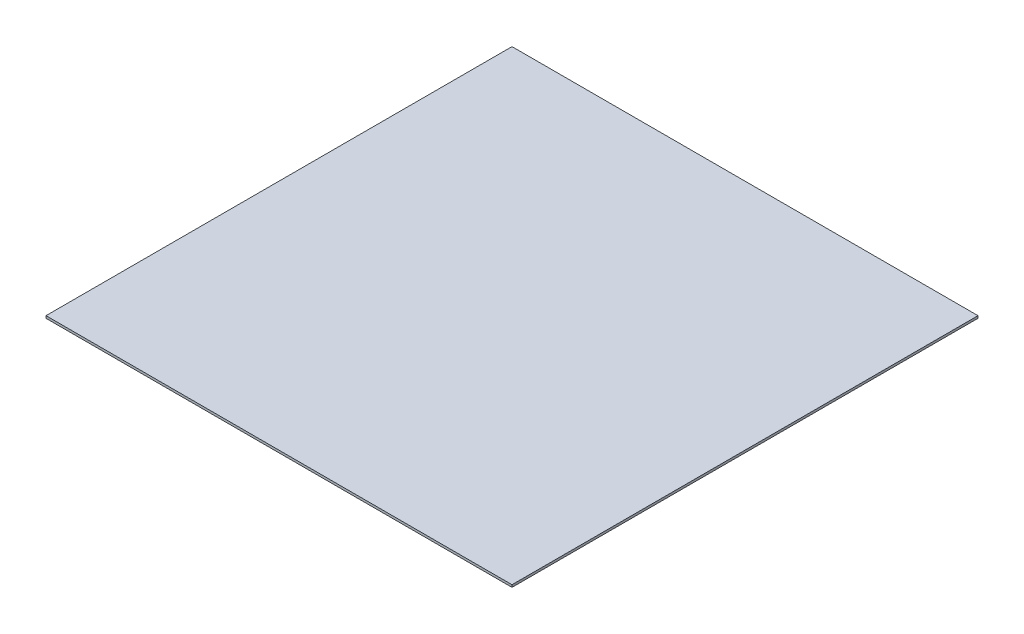
ISO-10303-21;
HEADER;
FILE_DESCRIPTION(('STEP AP214'),'2;1');
FILE_NAME('part.step','',(''),(''),'','','');
FILE_SCHEMA(('AUTOMOTIVE_DESIGN { 1 0 10303 214 1 1 1 1 }'));
ENDSEC;
DATA;
#1=APPLICATION_CONTEXT('core data for automotive mechanical design processes');
#2=APPLICATION_PROTOCOL_DEFINITION('international standard','automotive_design',2000,#1);
#3=PRODUCT_CONTEXT('',#1,'mechanical');
#4=PRODUCT('Part','Part','',(#3));
#5=PRODUCT_RELATED_PRODUCT_CATEGORY('part','',(#4));
#6=PRODUCT_DEFINITION_FORMATION('','',#4);
#7=PRODUCT_DEFINITION_CONTEXT('part definition',#1,'design');
#8=PRODUCT_DEFINITION('design','',#6,#7);
#9=PRODUCT_DEFINITION_SHAPE('','',#8);
#10=(LENGTH_UNIT() NAMED_UNIT(*) SI_UNIT(.MILLI.,.METRE.));
#11=(NAMED_UNIT(*) PLANE_ANGLE_UNIT() SI_UNIT($,.RADIAN.));
#12=(NAMED_UNIT(*) SI_UNIT($,.STERADIAN.) SOLID_ANGLE_UNIT());
#13=UNCERTAINTY_MEASURE_WITH_UNIT(LENGTH_MEASURE(1.E-05),#10,'distance_accuracy_value','');
#14=(GEOMETRIC_REPRESENTATION_CONTEXT(3) GLOBAL_UNCERTAINTY_ASSIGNED_CONTEXT((#13)) GLOBAL_UNIT_ASSIGNED_CONTEXT((#10,
#11,#12)) REPRESENTATION_CONTEXT('',''));
#15=CARTESIAN_POINT('',(0.,0.,0.));
#16=DIRECTION('',(0.,0.,1.));
#17=DIRECTION('',(1.,0.,0.));
#18=AXIS2_PLACEMENT_3D('',#15,#16,#17);
#19=CARTESIAN_POINT('',(1000.,10.,-1000.));
#20=DIRECTION('',(-1.,0.,0.));
#21=DIRECTION('',(0.,0.,1.));
#22=AXIS2_PLACEMENT_3D('',#19,#20,#21);
#23=PLANE('',#22);
#24=DIRECTION('',(0.,0.,-1.));
#25=VECTOR('',#24,1.);
#26=CARTESIAN_POINT('',(1000.,0.,-1000.));
#27=LINE('',#26,#25);
#28=CARTESIAN_POINT('',(1000.,0.,1000.));
#29=VERTEX_POINT('',#28);
#30=CARTESIAN_POINT('',(1000.,0.,-1000.));
#31=VERTEX_POINT('',#30);
#32=EDGE_CURVE('E119',#29,#31,#27,.T.);
#33=ORIENTED_EDGE('',*,*,#32,.T.);
#34=DIRECTION('',(0.,-1.,0.));
#35=VECTOR('',#34,1.);
#36=CARTESIAN_POINT('',(1000.,10.,-1000.));
#37=LINE('',#36,#35);
#38=CARTESIAN_POINT('',(1000.,10.,-1000.));
#39=VERTEX_POINT('',#38);
#40=EDGE_CURVE('E11',#39,#31,#37,.T.);
#41=ORIENTED_EDGE('',*,*,#40,.F.);
#42=DIRECTION('',(0.,0.,-1.));
#43=VECTOR('',#42,1.);
#44=CARTESIAN_POINT('',(1000.,10.,-1000.));
#45=LINE('',#44,#43);
#46=CARTESIAN_POINT('',(1000.,10.,1000.));
#47=VERTEX_POINT('',#46);
#48=EDGE_CURVE('E103',#47,#39,#45,.T.);
#49=ORIENTED_EDGE('',*,*,#48,.F.);
#50=DIRECTION('',(0.,-1.,0.));
#51=VECTOR('',#50,1.);
#52=CARTESIAN_POINT('',(1000.,10.,1000.));
#53=LINE('',#52,#51);
#54=EDGE_CURVE('E115',#47,#29,#53,.T.);
#55=ORIENTED_EDGE('',*,*,#54,.T.);
#56=EDGE_LOOP('',(#33,#41,#49,#55));
#57=FACE_BOUND('',#56,.T.);
#58=ADVANCED_FACE('F51',(#57),#23,.F.);
#59=CARTESIAN_POINT('',(-1000.,10.,-1000.));
#60=DIRECTION('',(0.,0.,1.));
#61=DIRECTION('',(1.,0.,0.));
#62=AXIS2_PLACEMENT_3D('',#59,#60,#61);
#63=PLANE('',#62);
#64=DIRECTION('',(-1.,0.,0.));
#65=VECTOR('',#64,1.);
#66=CARTESIAN_POINT('',(-1000.,0.,-1000.));
#67=LINE('',#66,#65);
#68=CARTESIAN_POINT('',(-1000.,0.,-1000.));
#69=VERTEX_POINT('',#68);
#70=EDGE_CURVE('E108',#31,#69,#67,.T.);
#71=ORIENTED_EDGE('',*,*,#70,.T.);
#72=DIRECTION('',(0.,-1.,0.));
#73=VECTOR('',#72,1.);
#74=CARTESIAN_POINT('',(-1000.,10.,-1000.));
#75=LINE('',#74,#73);
#76=CARTESIAN_POINT('',(-1000.,10.,-1000.));
#77=VERTEX_POINT('',#76);
#78=EDGE_CURVE('E60',#77,#69,#75,.T.);
#79=ORIENTED_EDGE('',*,*,#78,.F.);
#80=DIRECTION('',(-1.,0.,0.));
#81=VECTOR('',#80,1.);
#82=CARTESIAN_POINT('',(-1000.,10.,-1000.));
#83=LINE('',#82,#81);
#84=EDGE_CURVE('E98',#39,#77,#83,.T.);
#85=ORIENTED_EDGE('',*,*,#84,.F.);
#86=ORIENTED_EDGE('',*,*,#40,.T.);
#87=EDGE_LOOP('',(#71,#79,#85,#86));
#88=FACE_BOUND('',#87,.T.);
#89=ADVANCED_FACE('F107',(#88),#63,.F.);
#90=CARTESIAN_POINT('',(-1000.,10.,-1000.));
#91=DIRECTION('',(1.,0.,0.));
#92=DIRECTION('',(0.,0.,-1.));
#93=AXIS2_PLACEMENT_3D('',#90,#91,#92);
#94=PLANE('',#93);
#95=DIRECTION('',(0.,0.,1.));
#96=VECTOR('',#95,1.);
#97=CARTESIAN_POINT('',(-1000.,0.,-1000.));
#98=LINE('',#97,#96);
#99=CARTESIAN_POINT('',(-1000.,0.,1000.));
#100=VERTEX_POINT('',#99);
#101=EDGE_CURVE('E85',#69,#100,#98,.T.);
#102=ORIENTED_EDGE('',*,*,#101,.T.);
#103=DIRECTION('',(0.,-1.,0.));
#104=VECTOR('',#103,1.);
#105=CARTESIAN_POINT('',(-1000.,10.,1000.));
#106=LINE('',#105,#104);
#107=CARTESIAN_POINT('',(-1000.,10.,1000.));
#108=VERTEX_POINT('',#107);
#109=EDGE_CURVE('E110',#108,#100,#106,.T.);
#110=ORIENTED_EDGE('',*,*,#109,.F.);
#111=DIRECTION('',(0.,0.,1.));
#112=VECTOR('',#111,1.);
#113=CARTESIAN_POINT('',(-1000.,10.,-1000.));
#114=LINE('',#113,#112);
#115=EDGE_CURVE('E101',#77,#108,#114,.T.);
#116=ORIENTED_EDGE('',*,*,#115,.F.);
#117=ORIENTED_EDGE('',*,*,#78,.T.);
#118=EDGE_LOOP('',(#102,#110,#116,#117));
#119=FACE_BOUND('',#118,.T.);
#120=ADVANCED_FACE('F111',(#119),#94,.F.);
#121=CARTESIAN_POINT('',(-1000.,10.,1000.));
#122=DIRECTION('',(0.,0.,-1.));
#123=DIRECTION('',(-1.,0.,0.));
#124=AXIS2_PLACEMENT_3D('',#121,#122,#123);
#125=PLANE('',#124);
#126=DIRECTION('',(1.,0.,0.));
#127=VECTOR('',#126,1.);
#128=CARTESIAN_POINT('',(-1000.,0.,1000.));
#129=LINE('',#128,#127);
#130=EDGE_CURVE('E91',#100,#29,#129,.T.);
#131=ORIENTED_EDGE('',*,*,#130,.T.);
#132=ORIENTED_EDGE('',*,*,#54,.F.);
#133=DIRECTION('',(1.,0.,0.));
#134=VECTOR('',#133,1.);
#135=CARTESIAN_POINT('',(-1000.,10.,1000.));
#136=LINE('',#135,#134);
#137=EDGE_CURVE('E68',#108,#47,#136,.T.);
#138=ORIENTED_EDGE('',*,*,#137,.F.);
#139=ORIENTED_EDGE('',*,*,#109,.T.);
#140=EDGE_LOOP('',(#131,#132,#138,#139));
#141=FACE_BOUND('',#140,.T.);
#142=ADVANCED_FACE('F132',(#141),#125,.F.);
#143=CARTESIAN_POINT('',(0.,10.,0.));
#144=DIRECTION('',(0.,1.,0.));
#145=DIRECTION('',(0.,0.,1.));
#146=AXIS2_PLACEMENT_3D('',#143,#144,#145);
#147=PLANE('',#146);
#148=ORIENTED_EDGE('',*,*,#48,.T.);
#149=ORIENTED_EDGE('',*,*,#84,.T.);
#150=ORIENTED_EDGE('',*,*,#115,.T.);
#151=ORIENTED_EDGE('',*,*,#137,.T.);
#152=EDGE_LOOP('',(#148,#149,#150,#151));
#153=FACE_BOUND('',#152,.T.);
#154=ADVANCED_FACE('F99',(#153),#147,.T.);
#155=CARTESIAN_POINT('',(0.,0.,0.));
#156=DIRECTION('',(0.,1.,0.));
#157=DIRECTION('',(0.,0.,1.));
#158=AXIS2_PLACEMENT_3D('',#155,#156,#157);
#159=PLANE('',#158);
#160=ORIENTED_EDGE('',*,*,#32,.F.);
#161=ORIENTED_EDGE('',*,*,#130,.F.);
#162=ORIENTED_EDGE('',*,*,#101,.F.);
#163=ORIENTED_EDGE('',*,*,#70,.F.);
#164=EDGE_LOOP('',(#160,#161,#162,#163));
#165=FACE_BOUND('',#164,.T.);
#166=ADVANCED_FACE('F135',(#165),#159,.F.);
#167=CLOSED_SHELL('',(#58,#89,#120,#142,#154,#166));
#168=MANIFOLD_SOLID_BREP('B2',#167);
#169=ADVANCED_BREP_SHAPE_REPRESENTATION('',(#18,#168),#14);
#170=SHAPE_DEFINITION_REPRESENTATION(#9,#169);
ENDSEC;
END-ISO-10303-21;
